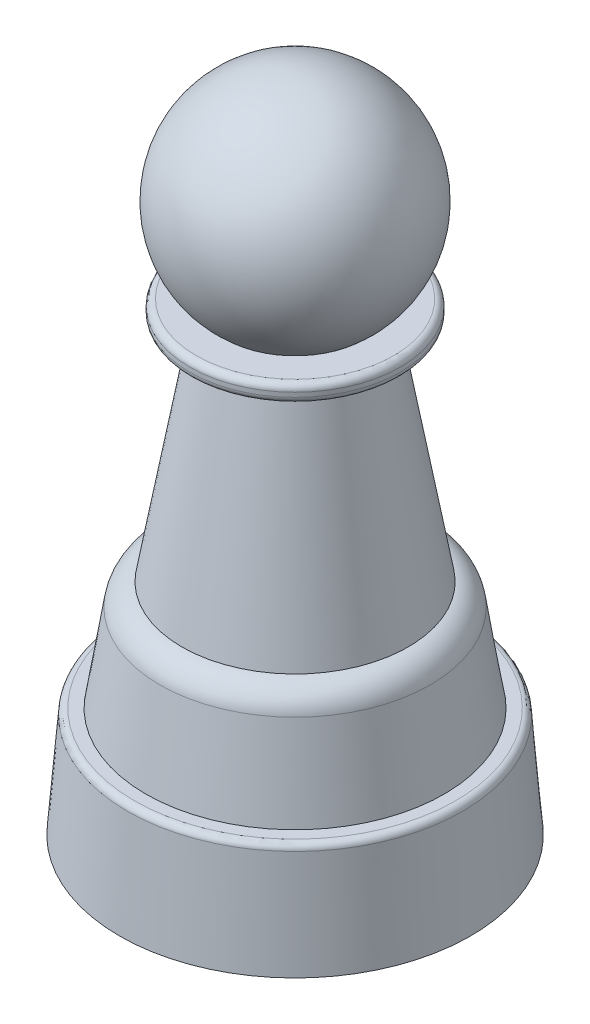
ISO-10303-21;
HEADER;
FILE_DESCRIPTION(('STEP AP214'),'2;1');
FILE_NAME('part.step','',(''),(''),'','','');
FILE_SCHEMA(('AUTOMOTIVE_DESIGN { 1 0 10303 214 1 1 1 1 }'));
ENDSEC;
DATA;
#1=APPLICATION_CONTEXT('core data for automotive mechanical design processes');
#2=APPLICATION_PROTOCOL_DEFINITION('international standard','automotive_design',2000,#1);
#3=PRODUCT_CONTEXT('',#1,'mechanical');
#4=PRODUCT('Part','Part','',(#3));
#5=PRODUCT_RELATED_PRODUCT_CATEGORY('part','',(#4));
#6=PRODUCT_DEFINITION_FORMATION('','',#4);
#7=PRODUCT_DEFINITION_CONTEXT('part definition',#1,'design');
#8=PRODUCT_DEFINITION('design','',#6,#7);
#9=PRODUCT_DEFINITION_SHAPE('','',#8);
#10=(LENGTH_UNIT() NAMED_UNIT(*) SI_UNIT(.MILLI.,.METRE.));
#11=(NAMED_UNIT(*) PLANE_ANGLE_UNIT() SI_UNIT($,.RADIAN.));
#12=(NAMED_UNIT(*) SI_UNIT($,.STERADIAN.) SOLID_ANGLE_UNIT());
#13=UNCERTAINTY_MEASURE_WITH_UNIT(LENGTH_MEASURE(1.E-05),#10,'distance_accuracy_value','');
#14=(GEOMETRIC_REPRESENTATION_CONTEXT(3) GLOBAL_UNCERTAINTY_ASSIGNED_CONTEXT((#13)) GLOBAL_UNIT_ASSIGNED_CONTEXT((#10,
#11,#12)) REPRESENTATION_CONTEXT('',''));
#15=CARTESIAN_POINT('',(0.,0.,0.));
#16=DIRECTION('',(0.,0.,1.));
#17=DIRECTION('',(1.,0.,0.));
#18=AXIS2_PLACEMENT_3D('',#15,#16,#17);
#19=CARTESIAN_POINT('',(0.,-18.9493192025654,0.));
#20=DIRECTION('',(0.,1.,0.));
#21=DIRECTION('',(0.,0.,1.));
#22=AXIS2_PLACEMENT_3D('',#19,#20,#21);
#23=TOROIDAL_SURFACE('',#22,18.3076038277609,0.750000000000001);
#24=CARTESIAN_POINT('',(0.,-18.8895102858532,0.));
#25=DIRECTION('',(0.,1.,0.));
#26=DIRECTION('',(0.,0.,1.));
#27=AXIS2_PLACEMENT_3D('',#24,#25,#26);
#28=CIRCLE('',#27,19.055215286663);
#29=CARTESIAN_POINT('',(0.,-18.8895102858532,19.055215286663));
#30=VERTEX_POINT('',#29);
#31=EDGE_CURVE('E94',#30,#30,#28,.T.);
#32=ORIENTED_EDGE('',*,*,#31,.T.);
#33=EDGE_LOOP('',(#32));
#34=FACE_BOUND('',#33,.T.);
#35=CARTESIAN_POINT('',(0.,-18.1993192025654,0.));
#36=DIRECTION('',(0.,1.,0.));
#37=DIRECTION('',(0.,0.,1.));
#38=AXIS2_PLACEMENT_3D('',#35,#36,#37);
#39=CIRCLE('',#38,18.3076038277609);
#40=CARTESIAN_POINT('',(0.,-18.1993192025654,18.3076038277609));
#41=VERTEX_POINT('',#40);
#42=EDGE_CURVE('E10',#41,#41,#39,.T.);
#43=ORIENTED_EDGE('',*,*,#42,.F.);
#44=EDGE_LOOP('',(#43));
#45=FACE_BOUND('',#44,.T.);
#46=ADVANCED_FACE('F43',(#34,#45),#23,.T.);
#47=CARTESIAN_POINT('',(0.,-18.1993192025654,0.));
#48=DIRECTION('',(0.,1.,0.));
#49=DIRECTION('',(0.,0.,1.));
#50=AXIS2_PLACEMENT_3D('',#47,#48,#49);
#51=PLANE('',#50);
#52=ORIENTED_EDGE('',*,*,#42,.T.);
#53=EDGE_LOOP('',(#52));
#54=FACE_BOUND('',#53,.T.);
#55=CARTESIAN_POINT('',(0.,-18.1993192025654,0.));
#56=DIRECTION('',(0.,1.,0.));
#57=DIRECTION('',(0.,0.,1.));
#58=AXIS2_PLACEMENT_3D('',#55,#56,#57);
#59=CIRCLE('',#58,17.);
#60=CARTESIAN_POINT('',(0.,-18.1993192025654,17.));
#61=VERTEX_POINT('',#60);
#62=EDGE_CURVE('E50',#61,#61,#59,.T.);
#63=ORIENTED_EDGE('',*,*,#62,.F.);
#64=EDGE_LOOP('',(#63));
#65=FACE_BOUND('',#64,.T.);
#66=ADVANCED_FACE('F113',(#54,#65),#51,.T.);
#67=CARTESIAN_POINT('',(0.,-8.22534769924535,0.));
#68=DIRECTION('',(0.,-1.,0.));
#69=DIRECTION('',(0.,0.,-1.));
#70=AXIS2_PLACEMENT_3D('',#67,#68,#69);
#71=CONICAL_SURFACE('',#70,15.4041645594688,0.158655262186401);
#72=ORIENTED_EDGE('',*,*,#62,.T.);
#73=EDGE_LOOP('',(#72));
#74=FACE_BOUND('',#73,.T.);
#75=CARTESIAN_POINT('',(0.,-8.22534769924535,0.));
#76=DIRECTION('',(0.,1.,0.));
#77=DIRECTION('',(0.,0.,1.));
#78=AXIS2_PLACEMENT_3D('',#75,#76,#77);
#79=CIRCLE('',#78,15.4041645594688);
#80=CARTESIAN_POINT('',(0.,-8.22534769924535,15.4041645594688));
#81=VERTEX_POINT('',#80);
#82=EDGE_CURVE('E55',#81,#81,#79,.T.);
#83=ORIENTED_EDGE('',*,*,#82,.F.);
#84=EDGE_LOOP('',(#83));
#85=FACE_BOUND('',#84,.T.);
#86=ADVANCED_FACE('F117',(#74,#85),#71,.T.);
#87=CARTESIAN_POINT('',(0.,-8.69931920256537,0.));
#88=DIRECTION('',(0.,1.,0.));
#89=DIRECTION('',(0.,0.,1.));
#90=AXIS2_PLACEMENT_3D('',#87,#88,#89);
#91=TOROIDAL_SURFACE('',#90,12.4418426637187,3.);
#92=CARTESIAN_POINT('',(0.,-5.73423225552914,0.));
#93=DIRECTION('',(0.,1.,0.));
#94=DIRECTION('',(0.,0.,1.));
#95=AXIS2_PLACEMENT_3D('',#92,#93,#94);
#96=CIRCLE('',#95,12.898197127393);
#97=CARTESIAN_POINT('',(0.,-5.73423225552914,12.898197127393));
#98=VERTEX_POINT('',#97);
#99=EDGE_CURVE('E60',#98,#98,#96,.T.);
#100=ORIENTED_EDGE('',*,*,#99,.F.);
#101=EDGE_LOOP('',(#100));
#102=FACE_BOUND('',#101,.T.);
#103=ORIENTED_EDGE('',*,*,#82,.T.);
#104=EDGE_LOOP('',(#103));
#105=FACE_BOUND('',#104,.T.);
#106=ADVANCED_FACE('F121',(#102,#105),#91,.T.);
#107=CARTESIAN_POINT('',(0.,20.1766770875912,0.));
#108=DIRECTION('',(0.,-1.,0.));
#109=DIRECTION('',(0.,0.,-1.));
#110=AXIS2_PLACEMENT_3D('',#107,#108,#109);
#111=CONICAL_SURFACE('',#110,8.32940471550977,0.174532925199434);
#112=ORIENTED_EDGE('',*,*,#99,.T.);
#113=EDGE_LOOP('',(#112));
#114=FACE_BOUND('',#113,.T.);
#115=CARTESIAN_POINT('',(0.,20.1766770875912,0.));
#116=DIRECTION('',(0.,1.,0.));
#117=DIRECTION('',(0.,0.,1.));
#118=AXIS2_PLACEMENT_3D('',#115,#116,#117);
#119=CIRCLE('',#118,8.32940471550977);
#120=CARTESIAN_POINT('',(0.,20.1766770875912,8.32940471550977));
#121=VERTEX_POINT('',#120);
#122=EDGE_CURVE('E66',#121,#121,#119,.T.);
#123=ORIENTED_EDGE('',*,*,#122,.F.);
#124=EDGE_LOOP('',(#123));
#125=FACE_BOUND('',#124,.T.);
#126=ADVANCED_FACE('F127',(#114,#125),#111,.T.);
#127=CARTESIAN_POINT('',(0.,20.1766770875912,0.));
#128=DIRECTION('',(0.,1.,0.));
#129=DIRECTION('',(0.,0.,1.));
#130=AXIS2_PLACEMENT_3D('',#127,#128,#129);
#131=PLANE('',#130);
#132=CARTESIAN_POINT('',(0.,20.1766770875912,0.));
#133=DIRECTION('',(0.,1.,0.));
#134=DIRECTION('',(0.,0.,1.));
#135=AXIS2_PLACEMENT_3D('',#132,#133,#134);
#136=CIRCLE('',#135,11.25);
#137=CARTESIAN_POINT('',(0.,20.1766770875912,11.25));
#138=VERTEX_POINT('',#137);
#139=EDGE_CURVE('E70',#138,#138,#136,.T.);
#140=ORIENTED_EDGE('',*,*,#139,.F.);
#141=EDGE_LOOP('',(#140));
#142=FACE_BOUND('',#141,.T.);
#143=ORIENTED_EDGE('',*,*,#122,.T.);
#144=EDGE_LOOP('',(#143));
#145=FACE_BOUND('',#144,.T.);
#146=ADVANCED_FACE('F131',(#142,#145),#131,.F.);
#147=CARTESIAN_POINT('',(0.,20.9266770875912,0.));
#148=DIRECTION('',(0.,1.,0.));
#149=DIRECTION('',(0.,0.,1.));
#150=AXIS2_PLACEMENT_3D('',#147,#148,#149);
#151=TOROIDAL_SURFACE('',#150,11.25,0.750000000000001);
#152=CARTESIAN_POINT('',(0.,20.9266770875912,0.));
#153=DIRECTION('',(0.,1.,0.));
#154=DIRECTION('',(0.,0.,1.));
#155=AXIS2_PLACEMENT_3D('',#152,#153,#154);
#156=CIRCLE('',#155,12.);
#157=CARTESIAN_POINT('',(0.,20.9266770875912,12.));
#158=VERTEX_POINT('',#157);
#159=EDGE_CURVE('E74',#158,#158,#156,.T.);
#160=ORIENTED_EDGE('',*,*,#159,.F.);
#161=EDGE_LOOP('',(#160));
#162=FACE_BOUND('',#161,.T.);
#163=ORIENTED_EDGE('',*,*,#139,.T.);
#164=EDGE_LOOP('',(#163));
#165=FACE_BOUND('',#164,.T.);
#166=ADVANCED_FACE('F135',(#162,#165),#151,.T.);
#167=CARTESIAN_POINT('',(0.,63.9051538423649,0.));
#168=DIRECTION('',(0.,1.,0.));
#169=DIRECTION('',(0.,0.,1.));
#170=AXIS2_PLACEMENT_3D('',#167,#168,#169);
#171=CYLINDRICAL_SURFACE('',#170,12.);
#172=ORIENTED_EDGE('',*,*,#159,.T.);
#173=EDGE_LOOP('',(#172));
#174=FACE_BOUND('',#173,.T.);
#175=CARTESIAN_POINT('',(0.,21.4266770875912,0.));
#176=DIRECTION('',(0.,1.,0.));
#177=DIRECTION('',(0.,0.,1.));
#178=AXIS2_PLACEMENT_3D('',#175,#176,#177);
#179=CIRCLE('',#178,12.);
#180=CARTESIAN_POINT('',(0.,21.4266770875912,12.));
#181=VERTEX_POINT('',#180);
#182=EDGE_CURVE('E78',#181,#181,#179,.T.);
#183=ORIENTED_EDGE('',*,*,#182,.F.);
#184=EDGE_LOOP('',(#183));
#185=FACE_BOUND('',#184,.T.);
#186=ADVANCED_FACE('F139',(#174,#185),#171,.T.);
#187=CARTESIAN_POINT('',(0.,21.4266770875912,0.));
#188=DIRECTION('',(0.,1.,0.));
#189=DIRECTION('',(0.,0.,1.));
#190=AXIS2_PLACEMENT_3D('',#187,#188,#189);
#191=TOROIDAL_SURFACE('',#190,11.25,0.750000000000001);
#192=ORIENTED_EDGE('',*,*,#182,.T.);
#193=EDGE_LOOP('',(#192));
#194=FACE_BOUND('',#193,.T.);
#195=CARTESIAN_POINT('',(0.,22.1766770875912,0.));
#196=DIRECTION('',(0.,1.,0.));
#197=DIRECTION('',(0.,0.,1.));
#198=AXIS2_PLACEMENT_3D('',#195,#196,#197);
#199=CIRCLE('',#198,11.25);
#200=CARTESIAN_POINT('',(0.,22.1766770875912,11.25));
#201=VERTEX_POINT('',#200);
#202=EDGE_CURVE('E82',#201,#201,#199,.T.);
#203=ORIENTED_EDGE('',*,*,#202,.F.);
#204=EDGE_LOOP('',(#203));
#205=FACE_BOUND('',#204,.T.);
#206=ADVANCED_FACE('F143',(#194,#205),#191,.T.);
#207=CARTESIAN_POINT('',(0.,22.1766770875912,0.));
#208=DIRECTION('',(0.,1.,0.));
#209=DIRECTION('',(0.,0.,1.));
#210=AXIS2_PLACEMENT_3D('',#207,#208,#209);
#211=PLANE('',#210);
#212=ORIENTED_EDGE('',*,*,#202,.T.);
#213=EDGE_LOOP('',(#212));
#214=FACE_BOUND('',#213,.T.);
#215=CARTESIAN_POINT('',(0.,22.1766770875912,0.));
#216=DIRECTION('',(0.,1.,0.));
#217=DIRECTION('',(0.,0.,1.));
#218=AXIS2_PLACEMENT_3D('',#215,#216,#217);
#219=CIRCLE('',#218,7.97675075409284);
#220=CARTESIAN_POINT('',(0.,22.1766770875912,7.97675075409284));
#221=VERTEX_POINT('',#220);
#222=EDGE_CURVE('E86',#221,#221,#219,.T.);
#223=ORIENTED_EDGE('',*,*,#222,.F.);
#224=EDGE_LOOP('',(#223));
#225=FACE_BOUND('',#224,.T.);
#226=ADVANCED_FACE('F147',(#214,#225),#211,.T.);
#227=CARTESIAN_POINT('',(0.,31.8006807974346,0.));
#228=DIRECTION('',(0.,1.,0.));
#229=DIRECTION('',(0.,0.,-1.));
#230=AXIS2_PLACEMENT_3D('',#227,#228,#229);
#231=SPHERICAL_SURFACE('',#230,12.5);
#232=ORIENTED_EDGE('',*,*,#222,.T.);
#233=EDGE_LOOP('',(#232));
#234=FACE_BOUND('',#233,.T.);
#235=ADVANCED_FACE('F109',(#234),#231,.T.);
#236=CARTESIAN_POINT('',(0.,-30.6993192025654,0.));
#237=DIRECTION('',(0.,-1.,0.));
#238=DIRECTION('',(0.,0.,-1.));
#239=AXIS2_PLACEMENT_3D('',#236,#237,#238);
#240=PLANE('',#239);
#241=CARTESIAN_POINT('',(0.,-30.6993192025654,0.));
#242=DIRECTION('',(0.,1.,0.));
#243=DIRECTION('',(0.,0.,1.));
#244=AXIS2_PLACEMENT_3D('',#241,#242,#243);
#245=CIRCLE('',#244,20.);
#246=CARTESIAN_POINT('',(0.,-30.6993192025654,20.));
#247=VERTEX_POINT('',#246);
#248=EDGE_CURVE('E90',#247,#247,#245,.T.);
#249=ORIENTED_EDGE('',*,*,#248,.F.);
#250=EDGE_LOOP('',(#249));
#251=FACE_BOUND('',#250,.T.);
#252=ADVANCED_FACE('F103',(#251),#240,.T.);
#253=CARTESIAN_POINT('',(0.,-18.8895102858532,0.));
#254=DIRECTION('',(0.,-1.,0.));
#255=DIRECTION('',(0.,0.,-1.));
#256=AXIS2_PLACEMENT_3D('',#253,#254,#255);
#257=CONICAL_SURFACE('',#256,19.055215286663,0.0798299857122371);
#258=ORIENTED_EDGE('',*,*,#248,.T.);
#259=EDGE_LOOP('',(#258));
#260=FACE_BOUND('',#259,.T.);
#261=ORIENTED_EDGE('',*,*,#31,.F.);
#262=EDGE_LOOP('',(#261));
#263=FACE_BOUND('',#262,.T.);
#264=ADVANCED_FACE('F101',(#260,#263),#257,.T.);
#265=CLOSED_SHELL('',(#46,#66,#86,#106,#126,#146,#166,#186,#206,#226,#235,#252,#264));
#266=MANIFOLD_SOLID_BREP('B2',#265);
#267=ADVANCED_BREP_SHAPE_REPRESENTATION('',(#18,#266),#14);
#268=SHAPE_DEFINITION_REPRESENTATION(#9,#267);
ENDSEC;
END-ISO-10303-21;
